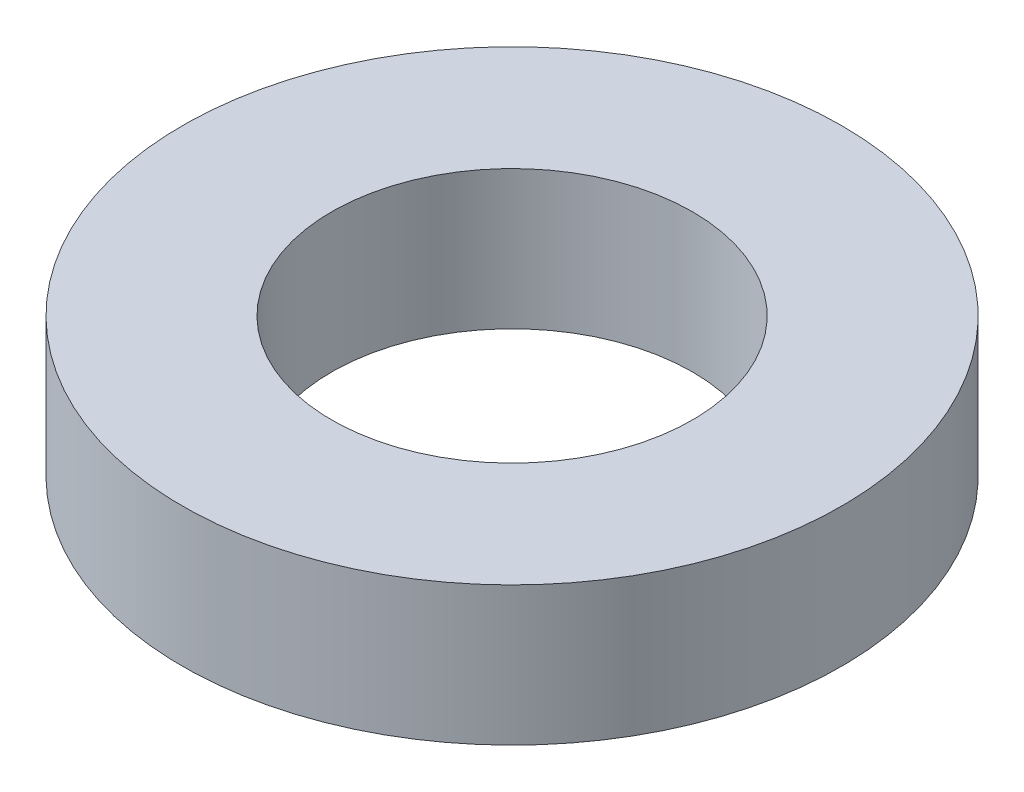
ISO-10303-21;
HEADER;
FILE_DESCRIPTION(('STEP AP214'),'2;1');
FILE_NAME('part.step','',(''),(''),'','','');
FILE_SCHEMA(('AUTOMOTIVE_DESIGN { 1 0 10303 214 1 1 1 1 }'));
ENDSEC;
DATA;
#1=APPLICATION_CONTEXT('core data for automotive mechanical design processes');
#2=APPLICATION_PROTOCOL_DEFINITION('international standard','automotive_design',2000,#1);
#3=PRODUCT_CONTEXT('',#1,'mechanical');
#4=PRODUCT('Part','Part','',(#3));
#5=PRODUCT_RELATED_PRODUCT_CATEGORY('part','',(#4));
#6=PRODUCT_DEFINITION_FORMATION('','',#4);
#7=PRODUCT_DEFINITION_CONTEXT('part definition',#1,'design');
#8=PRODUCT_DEFINITION('design','',#6,#7);
#9=PRODUCT_DEFINITION_SHAPE('','',#8);
#10=(LENGTH_UNIT() NAMED_UNIT(*) SI_UNIT(.MILLI.,.METRE.));
#11=(NAMED_UNIT(*) PLANE_ANGLE_UNIT() SI_UNIT($,.RADIAN.));
#12=(NAMED_UNIT(*) SI_UNIT($,.STERADIAN.) SOLID_ANGLE_UNIT());
#13=UNCERTAINTY_MEASURE_WITH_UNIT(LENGTH_MEASURE(1.E-05),#10,'distance_accuracy_value','');
#14=(GEOMETRIC_REPRESENTATION_CONTEXT(3) GLOBAL_UNCERTAINTY_ASSIGNED_CONTEXT((#13)) GLOBAL_UNIT_ASSIGNED_CONTEXT((#10,
#11,#12)) REPRESENTATION_CONTEXT('',''));
#15=CARTESIAN_POINT('',(0.,0.,0.));
#16=DIRECTION('',(0.,0.,1.));
#17=DIRECTION('',(1.,0.,0.));
#18=AXIS2_PLACEMENT_3D('',#15,#16,#17);
#19=CARTESIAN_POINT('',(0.,2.,0.));
#20=DIRECTION('',(0.,1.,0.));
#21=DIRECTION('',(0.,0.,-1.));
#22=AXIS2_PLACEMENT_3D('',#19,#20,#21);
#23=PLANE('',#22);
#24=CARTESIAN_POINT('',(0.,2.,0.));
#25=DIRECTION('',(0.,-1.,0.));
#26=DIRECTION('',(0.,0.,-1.));
#27=AXIS2_PLACEMENT_3D('',#24,#25,#26);
#28=CIRCLE('',#27,4.75);
#29=CARTESIAN_POINT('',(0.,2.,-4.75));
#30=VERTEX_POINT('',#29);
#31=EDGE_CURVE('E10',#30,#30,#28,.T.);
#32=ORIENTED_EDGE('',*,*,#31,.F.);
#33=EDGE_LOOP('',(#32));
#34=FACE_BOUND('',#33,.T.);
#35=CARTESIAN_POINT('',(0.,2.,0.));
#36=DIRECTION('',(0.,-1.,0.));
#37=DIRECTION('',(0.,0.,-1.));
#38=AXIS2_PLACEMENT_3D('',#35,#36,#37);
#39=CIRCLE('',#38,2.6);
#40=CARTESIAN_POINT('',(0.,2.,-2.6));
#41=VERTEX_POINT('',#40);
#42=EDGE_CURVE('E44',#41,#41,#39,.T.);
#43=ORIENTED_EDGE('',*,*,#42,.T.);
#44=EDGE_LOOP('',(#43));
#45=FACE_BOUND('',#44,.T.);
#46=ADVANCED_FACE('F33',(#34,#45),#23,.T.);
#47=CARTESIAN_POINT('',(0.,0.,0.));
#48=DIRECTION('',(0.,1.,0.));
#49=DIRECTION('',(0.,0.,-1.));
#50=AXIS2_PLACEMENT_3D('',#47,#48,#49);
#51=PLANE('',#50);
#52=CARTESIAN_POINT('',(0.,0.,0.));
#53=DIRECTION('',(0.,-1.,0.));
#54=DIRECTION('',(0.,0.,-1.));
#55=AXIS2_PLACEMENT_3D('',#52,#53,#54);
#56=CIRCLE('',#55,4.75);
#57=CARTESIAN_POINT('',(0.,0.,-4.75));
#58=VERTEX_POINT('',#57);
#59=EDGE_CURVE('E37',#58,#58,#56,.T.);
#60=ORIENTED_EDGE('',*,*,#59,.T.);
#61=EDGE_LOOP('',(#60));
#62=FACE_BOUND('',#61,.T.);
#63=CARTESIAN_POINT('',(0.,0.,0.));
#64=DIRECTION('',(0.,-1.,0.));
#65=DIRECTION('',(0.,0.,-1.));
#66=AXIS2_PLACEMENT_3D('',#63,#64,#65);
#67=CIRCLE('',#66,2.6);
#68=CARTESIAN_POINT('',(0.,0.,-2.6));
#69=VERTEX_POINT('',#68);
#70=EDGE_CURVE('E46',#69,#69,#67,.T.);
#71=ORIENTED_EDGE('',*,*,#70,.F.);
#72=EDGE_LOOP('',(#71));
#73=FACE_BOUND('',#72,.T.);
#74=ADVANCED_FACE('F59',(#62,#73),#51,.F.);
#75=CARTESIAN_POINT('',(0.,2.,0.));
#76=DIRECTION('',(0.,-1.,0.));
#77=DIRECTION('',(0.,0.,1.));
#78=AXIS2_PLACEMENT_3D('',#75,#76,#77);
#79=CYLINDRICAL_SURFACE('',#78,4.75);
#80=ORIENTED_EDGE('',*,*,#31,.T.);
#81=EDGE_LOOP('',(#80));
#82=FACE_BOUND('',#81,.T.);
#83=ORIENTED_EDGE('',*,*,#59,.F.);
#84=EDGE_LOOP('',(#83));
#85=FACE_BOUND('',#84,.T.);
#86=ADVANCED_FACE('F35',(#82,#85),#79,.T.);
#87=CARTESIAN_POINT('',(0.,2.,0.));
#88=DIRECTION('',(0.,-1.,0.));
#89=DIRECTION('',(0.,0.,1.));
#90=AXIS2_PLACEMENT_3D('',#87,#88,#89);
#91=CYLINDRICAL_SURFACE('',#90,2.6);
#92=ORIENTED_EDGE('',*,*,#42,.F.);
#93=EDGE_LOOP('',(#92));
#94=FACE_BOUND('',#93,.T.);
#95=ORIENTED_EDGE('',*,*,#70,.T.);
#96=EDGE_LOOP('',(#95));
#97=FACE_BOUND('',#96,.T.);
#98=ADVANCED_FACE('F53',(#94,#97),#91,.F.);
#99=CLOSED_SHELL('',(#46,#74,#86,#98));
#100=MANIFOLD_SOLID_BREP('B2',#99);
#101=ADVANCED_BREP_SHAPE_REPRESENTATION('',(#18,#100),#14);
#102=SHAPE_DEFINITION_REPRESENTATION(#9,#101);
ENDSEC;
END-ISO-10303-21;
